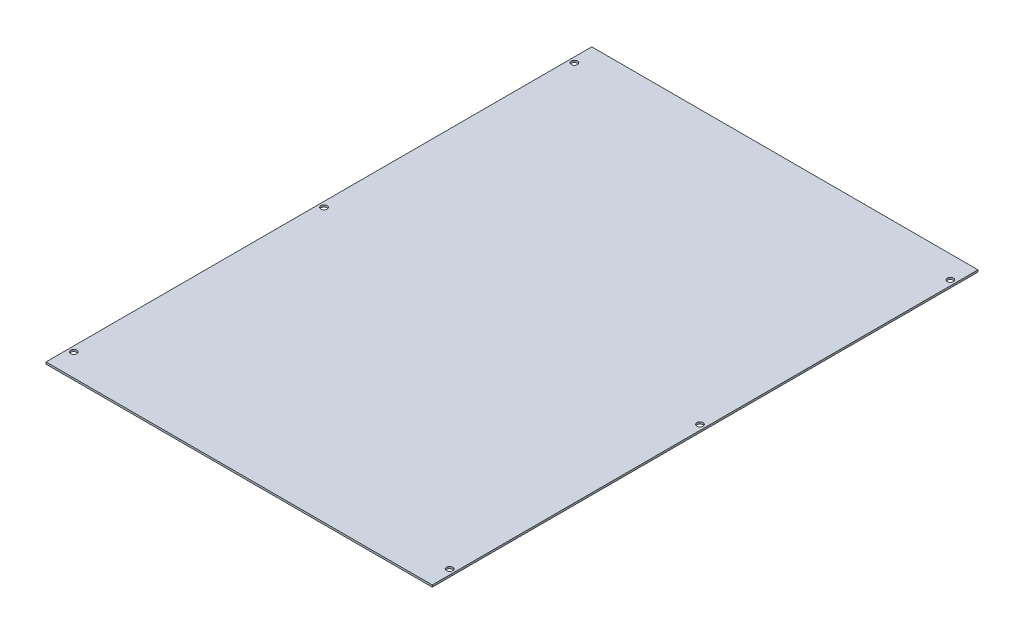
ISO-10303-21;
HEADER;
FILE_DESCRIPTION(('STEP AP214'),'2;1');
FILE_NAME('part.step','',(''),(''),'','','');
FILE_SCHEMA(('AUTOMOTIVE_DESIGN { 1 0 10303 214 1 1 1 1 }'));
ENDSEC;
DATA;
#1=APPLICATION_CONTEXT('core data for automotive mechanical design processes');
#2=APPLICATION_PROTOCOL_DEFINITION('international standard','automotive_design',2000,#1);
#3=PRODUCT_CONTEXT('',#1,'mechanical');
#4=PRODUCT('Part','Part','',(#3));
#5=PRODUCT_RELATED_PRODUCT_CATEGORY('part','',(#4));
#6=PRODUCT_DEFINITION_FORMATION('','',#4);
#7=PRODUCT_DEFINITION_CONTEXT('part definition',#1,'design');
#8=PRODUCT_DEFINITION('design','',#6,#7);
#9=PRODUCT_DEFINITION_SHAPE('','',#8);
#10=(LENGTH_UNIT() NAMED_UNIT(*) SI_UNIT(.MILLI.,.METRE.));
#11=(NAMED_UNIT(*) PLANE_ANGLE_UNIT() SI_UNIT($,.RADIAN.));
#12=(NAMED_UNIT(*) SI_UNIT($,.STERADIAN.) SOLID_ANGLE_UNIT());
#13=UNCERTAINTY_MEASURE_WITH_UNIT(LENGTH_MEASURE(1.E-05),#10,'distance_accuracy_value','');
#14=(GEOMETRIC_REPRESENTATION_CONTEXT(3) GLOBAL_UNCERTAINTY_ASSIGNED_CONTEXT((#13)) GLOBAL_UNIT_ASSIGNED_CONTEXT((#10,
#11,#12)) REPRESENTATION_CONTEXT('',''));
#15=CARTESIAN_POINT('',(0.,0.,0.));
#16=DIRECTION('',(0.,0.,1.));
#17=DIRECTION('',(1.,0.,0.));
#18=AXIS2_PLACEMENT_3D('',#15,#16,#17);
#19=CARTESIAN_POINT('',(159.25,1.6002,225.));
#20=DIRECTION('',(-1.,0.,0.));
#21=DIRECTION('',(0.,0.,1.));
#22=AXIS2_PLACEMENT_3D('',#19,#20,#21);
#23=PLANE('',#22);
#24=DIRECTION('',(0.,0.,-1.));
#25=VECTOR('',#24,1.);
#26=CARTESIAN_POINT('',(159.25,0.,225.));
#27=LINE('',#26,#25);
#28=CARTESIAN_POINT('',(159.25,0.,225.));
#29=VERTEX_POINT('',#28);
#30=CARTESIAN_POINT('',(159.25,0.,-225.));
#31=VERTEX_POINT('',#30);
#32=EDGE_CURVE('E98',#29,#31,#27,.T.);
#33=ORIENTED_EDGE('',*,*,#32,.T.);
#34=DIRECTION('',(0.,-1.,0.));
#35=VECTOR('',#34,1.);
#36=CARTESIAN_POINT('',(159.25,1.6002,-225.));
#37=LINE('',#36,#35);
#38=CARTESIAN_POINT('',(159.25,1.6002,-225.));
#39=VERTEX_POINT('',#38);
#40=EDGE_CURVE('E11',#39,#31,#37,.T.);
#41=ORIENTED_EDGE('',*,*,#40,.F.);
#42=DIRECTION('',(0.,0.,-1.));
#43=VECTOR('',#42,1.);
#44=CARTESIAN_POINT('',(159.25,1.6002,225.));
#45=LINE('',#44,#43);
#46=CARTESIAN_POINT('',(159.25,1.6002,225.));
#47=VERTEX_POINT('',#46);
#48=EDGE_CURVE('E85',#47,#39,#45,.T.);
#49=ORIENTED_EDGE('',*,*,#48,.F.);
#50=DIRECTION('',(0.,-1.,0.));
#51=VECTOR('',#50,1.);
#52=CARTESIAN_POINT('',(159.25,1.6002,225.));
#53=LINE('',#52,#51);
#54=EDGE_CURVE('E94',#47,#29,#53,.T.);
#55=ORIENTED_EDGE('',*,*,#54,.T.);
#56=EDGE_LOOP('',(#33,#41,#49,#55));
#57=FACE_BOUND('',#56,.T.);
#58=ADVANCED_FACE('F32',(#57),#23,.F.);
#59=CARTESIAN_POINT('',(-159.25,1.6002,-225.));
#60=DIRECTION('',(0.,0.,1.));
#61=DIRECTION('',(1.,0.,0.));
#62=AXIS2_PLACEMENT_3D('',#59,#60,#61);
#63=PLANE('',#62);
#64=DIRECTION('',(-1.,0.,0.));
#65=VECTOR('',#64,1.);
#66=CARTESIAN_POINT('',(-159.25,0.,-225.));
#67=LINE('',#66,#65);
#68=CARTESIAN_POINT('',(-159.25,0.,-225.));
#69=VERTEX_POINT('',#68);
#70=EDGE_CURVE('E89',#31,#69,#67,.T.);
#71=ORIENTED_EDGE('',*,*,#70,.T.);
#72=DIRECTION('',(0.,-1.,0.));
#73=VECTOR('',#72,1.);
#74=CARTESIAN_POINT('',(-159.25,1.6002,-225.));
#75=LINE('',#74,#73);
#76=CARTESIAN_POINT('',(-159.25,1.6002,-225.));
#77=VERTEX_POINT('',#76);
#78=EDGE_CURVE('E41',#77,#69,#75,.T.);
#79=ORIENTED_EDGE('',*,*,#78,.F.);
#80=DIRECTION('',(-1.,0.,0.));
#81=VECTOR('',#80,1.);
#82=CARTESIAN_POINT('',(-159.25,1.6002,-225.));
#83=LINE('',#82,#81);
#84=EDGE_CURVE('E80',#39,#77,#83,.T.);
#85=ORIENTED_EDGE('',*,*,#84,.F.);
#86=ORIENTED_EDGE('',*,*,#40,.T.);
#87=EDGE_LOOP('',(#71,#79,#85,#86));
#88=FACE_BOUND('',#87,.T.);
#89=ADVANCED_FACE('F88',(#88),#63,.F.);
#90=CARTESIAN_POINT('',(-159.25,1.6002,225.));
#91=DIRECTION('',(1.,0.,0.));
#92=DIRECTION('',(0.,0.,-1.));
#93=AXIS2_PLACEMENT_3D('',#90,#91,#92);
#94=PLANE('',#93);
#95=DIRECTION('',(0.,0.,1.));
#96=VECTOR('',#95,1.);
#97=CARTESIAN_POINT('',(-159.25,0.,225.));
#98=LINE('',#97,#96);
#99=CARTESIAN_POINT('',(-159.25,0.,225.));
#100=VERTEX_POINT('',#99);
#101=EDGE_CURVE('E67',#69,#100,#98,.T.);
#102=ORIENTED_EDGE('',*,*,#101,.T.);
#103=DIRECTION('',(0.,-1.,0.));
#104=VECTOR('',#103,1.);
#105=CARTESIAN_POINT('',(-159.25,1.6002,225.));
#106=LINE('',#105,#104);
#107=CARTESIAN_POINT('',(-159.25,1.6002,225.));
#108=VERTEX_POINT('',#107);
#109=EDGE_CURVE('E90',#108,#100,#106,.T.);
#110=ORIENTED_EDGE('',*,*,#109,.F.);
#111=DIRECTION('',(0.,0.,1.));
#112=VECTOR('',#111,1.);
#113=CARTESIAN_POINT('',(-159.25,1.6002,225.));
#114=LINE('',#113,#112);
#115=EDGE_CURVE('E83',#77,#108,#114,.T.);
#116=ORIENTED_EDGE('',*,*,#115,.F.);
#117=ORIENTED_EDGE('',*,*,#78,.T.);
#118=EDGE_LOOP('',(#102,#110,#116,#117));
#119=FACE_BOUND('',#118,.T.);
#120=ADVANCED_FACE('F92',(#119),#94,.F.);
#121=CARTESIAN_POINT('',(-159.25,1.6002,225.));
#122=DIRECTION('',(0.,0.,-1.));
#123=DIRECTION('',(-1.,0.,0.));
#124=AXIS2_PLACEMENT_3D('',#121,#122,#123);
#125=PLANE('',#124);
#126=DIRECTION('',(1.,0.,0.));
#127=VECTOR('',#126,1.);
#128=CARTESIAN_POINT('',(-159.25,0.,225.));
#129=LINE('',#128,#127);
#130=EDGE_CURVE('E73',#100,#29,#129,.T.);
#131=ORIENTED_EDGE('',*,*,#130,.T.);
#132=ORIENTED_EDGE('',*,*,#54,.F.);
#133=DIRECTION('',(1.,0.,0.));
#134=VECTOR('',#133,1.);
#135=CARTESIAN_POINT('',(-159.25,1.6002,225.));
#136=LINE('',#135,#134);
#137=EDGE_CURVE('E50',#108,#47,#136,.T.);
#138=ORIENTED_EDGE('',*,*,#137,.F.);
#139=ORIENTED_EDGE('',*,*,#109,.T.);
#140=EDGE_LOOP('',(#131,#132,#138,#139));
#141=FACE_BOUND('',#140,.T.);
#142=ADVANCED_FACE('F143',(#141),#125,.F.);
#143=CARTESIAN_POINT('',(0.,1.6002,0.));
#144=DIRECTION('',(0.,-1.,0.));
#145=DIRECTION('',(0.,0.,-1.));
#146=AXIS2_PLACEMENT_3D('',#143,#144,#145);
#147=PLANE('',#146);
#148=CARTESIAN_POINT('',(-155.,1.6002,-206.45));
#149=DIRECTION('',(0.,1.,0.));
#150=DIRECTION('',(0.,0.,1.));
#151=AXIS2_PLACEMENT_3D('',#148,#149,#150);
#152=CIRCLE('',#151,2.55269999999999);
#153=CARTESIAN_POINT('',(-155.,1.6002,-203.8973));
#154=VERTEX_POINT('',#153);
#155=EDGE_CURVE('E245',#154,#154,#152,.T.);
#156=ORIENTED_EDGE('',*,*,#155,.F.);
#157=EDGE_LOOP('',(#156));
#158=FACE_BOUND('',#157,.T.);
#159=CARTESIAN_POINT('',(155.,1.6002,-206.45));
#160=DIRECTION('',(0.,1.,0.));
#161=DIRECTION('',(0.,0.,1.));
#162=AXIS2_PLACEMENT_3D('',#159,#160,#161);
#163=CIRCLE('',#162,2.55269999999999);
#164=CARTESIAN_POINT('',(155.,1.6002,-203.8973));
#165=VERTEX_POINT('',#164);
#166=EDGE_CURVE('E247',#165,#165,#163,.T.);
#167=ORIENTED_EDGE('',*,*,#166,.F.);
#168=EDGE_LOOP('',(#167));
#169=FACE_BOUND('',#168,.T.);
#170=CARTESIAN_POINT('',(155.,1.6002,0.));
#171=DIRECTION('',(0.,1.,0.));
#172=DIRECTION('',(0.,0.,1.));
#173=AXIS2_PLACEMENT_3D('',#170,#171,#172);
#174=CIRCLE('',#173,2.55269999999999);
#175=CARTESIAN_POINT('',(155.,1.6002,2.55269999999994));
#176=VERTEX_POINT('',#175);
#177=EDGE_CURVE('E124',#176,#176,#174,.T.);
#178=ORIENTED_EDGE('',*,*,#177,.F.);
#179=EDGE_LOOP('',(#178));
#180=FACE_BOUND('',#179,.T.);
#181=CARTESIAN_POINT('',(155.,1.6002,206.45));
#182=DIRECTION('',(0.,1.,0.));
#183=DIRECTION('',(0.,0.,1.));
#184=AXIS2_PLACEMENT_3D('',#181,#182,#183);
#185=CIRCLE('',#184,2.55269999999999);
#186=CARTESIAN_POINT('',(155.,1.6002,209.0027));
#187=VERTEX_POINT('',#186);
#188=EDGE_CURVE('E113',#187,#187,#185,.T.);
#189=ORIENTED_EDGE('',*,*,#188,.F.);
#190=EDGE_LOOP('',(#189));
#191=FACE_BOUND('',#190,.T.);
#192=CARTESIAN_POINT('',(-155.,1.6002,206.45));
#193=DIRECTION('',(0.,1.,0.));
#194=DIRECTION('',(0.,0.,1.));
#195=AXIS2_PLACEMENT_3D('',#192,#193,#194);
#196=CIRCLE('',#195,2.55269999999999);
#197=CARTESIAN_POINT('',(-155.,1.6002,209.0027));
#198=VERTEX_POINT('',#197);
#199=EDGE_CURVE('E110',#198,#198,#196,.T.);
#200=ORIENTED_EDGE('',*,*,#199,.F.);
#201=EDGE_LOOP('',(#200));
#202=FACE_BOUND('',#201,.T.);
#203=CARTESIAN_POINT('',(-155.,1.6002,0.));
#204=DIRECTION('',(0.,1.,0.));
#205=DIRECTION('',(0.,0.,1.));
#206=AXIS2_PLACEMENT_3D('',#203,#204,#205);
#207=CIRCLE('',#206,2.55269999999999);
#208=CARTESIAN_POINT('',(-155.,1.6002,2.55269999999994));
#209=VERTEX_POINT('',#208);
#210=EDGE_CURVE('E109',#209,#209,#207,.T.);
#211=ORIENTED_EDGE('',*,*,#210,.F.);
#212=EDGE_LOOP('',(#211));
#213=FACE_BOUND('',#212,.T.);
#214=ORIENTED_EDGE('',*,*,#48,.T.);
#215=ORIENTED_EDGE('',*,*,#84,.T.);
#216=ORIENTED_EDGE('',*,*,#115,.T.);
#217=ORIENTED_EDGE('',*,*,#137,.T.);
#218=EDGE_LOOP('',(#214,#215,#216,#217));
#219=FACE_BOUND('',#218,.T.);
#220=ADVANCED_FACE('F81',(#158,#169,#180,#191,#202,#213,#219),#147,.F.);
#221=CARTESIAN_POINT('',(0.,0.,0.));
#222=DIRECTION('',(0.,-1.,0.));
#223=DIRECTION('',(0.,0.,-1.));
#224=AXIS2_PLACEMENT_3D('',#221,#222,#223);
#225=PLANE('',#224);
#226=CARTESIAN_POINT('',(-155.,0.,-206.45));
#227=DIRECTION('',(0.,-1.,0.));
#228=DIRECTION('',(0.,0.,-1.));
#229=AXIS2_PLACEMENT_3D('',#226,#227,#228);
#230=CIRCLE('',#229,2.55269999999998);
#231=CARTESIAN_POINT('',(-155.,0.,-209.0027));
#232=VERTEX_POINT('',#231);
#233=EDGE_CURVE('E35',#232,#232,#230,.T.);
#234=ORIENTED_EDGE('',*,*,#233,.F.);
#235=EDGE_LOOP('',(#234));
#236=FACE_BOUND('',#235,.T.);
#237=CARTESIAN_POINT('',(155.,0.,-206.45));
#238=DIRECTION('',(0.,-1.,0.));
#239=DIRECTION('',(0.,0.,-1.));
#240=AXIS2_PLACEMENT_3D('',#237,#238,#239);
#241=CIRCLE('',#240,2.55269999999998);
#242=CARTESIAN_POINT('',(155.,0.,-209.0027));
#243=VERTEX_POINT('',#242);
#244=EDGE_CURVE('E251',#243,#243,#241,.T.);
#245=ORIENTED_EDGE('',*,*,#244,.F.);
#246=EDGE_LOOP('',(#245));
#247=FACE_BOUND('',#246,.T.);
#248=CARTESIAN_POINT('',(155.,0.,0.));
#249=DIRECTION('',(0.,-1.,0.));
#250=DIRECTION('',(0.,0.,-1.));
#251=AXIS2_PLACEMENT_3D('',#248,#249,#250);
#252=CIRCLE('',#251,2.55269999999998);
#253=CARTESIAN_POINT('',(155.,0.,-2.55270000000003));
#254=VERTEX_POINT('',#253);
#255=EDGE_CURVE('E119',#254,#254,#252,.T.);
#256=ORIENTED_EDGE('',*,*,#255,.F.);
#257=EDGE_LOOP('',(#256));
#258=FACE_BOUND('',#257,.T.);
#259=CARTESIAN_POINT('',(155.,0.,206.45));
#260=DIRECTION('',(0.,-1.,0.));
#261=DIRECTION('',(0.,0.,-1.));
#262=AXIS2_PLACEMENT_3D('',#259,#260,#261);
#263=CIRCLE('',#262,2.55269999999998);
#264=CARTESIAN_POINT('',(155.,0.,203.8973));
#265=VERTEX_POINT('',#264);
#266=EDGE_CURVE('E111',#265,#265,#263,.T.);
#267=ORIENTED_EDGE('',*,*,#266,.F.);
#268=EDGE_LOOP('',(#267));
#269=FACE_BOUND('',#268,.T.);
#270=CARTESIAN_POINT('',(-155.,0.,206.45));
#271=DIRECTION('',(0.,-1.,0.));
#272=DIRECTION('',(0.,0.,-1.));
#273=AXIS2_PLACEMENT_3D('',#270,#271,#272);
#274=CIRCLE('',#273,2.55269999999998);
#275=CARTESIAN_POINT('',(-155.,0.,203.8973));
#276=VERTEX_POINT('',#275);
#277=EDGE_CURVE('E107',#276,#276,#274,.T.);
#278=ORIENTED_EDGE('',*,*,#277,.F.);
#279=EDGE_LOOP('',(#278));
#280=FACE_BOUND('',#279,.T.);
#281=CARTESIAN_POINT('',(-155.,0.,0.));
#282=DIRECTION('',(0.,-1.,0.));
#283=DIRECTION('',(0.,0.,-1.));
#284=AXIS2_PLACEMENT_3D('',#281,#282,#283);
#285=CIRCLE('',#284,2.55269999999998);
#286=CARTESIAN_POINT('',(-155.,0.,-2.55270000000003));
#287=VERTEX_POINT('',#286);
#288=EDGE_CURVE('E101',#287,#287,#285,.T.);
#289=ORIENTED_EDGE('',*,*,#288,.F.);
#290=EDGE_LOOP('',(#289));
#291=FACE_BOUND('',#290,.T.);
#292=ORIENTED_EDGE('',*,*,#32,.F.);
#293=ORIENTED_EDGE('',*,*,#130,.F.);
#294=ORIENTED_EDGE('',*,*,#101,.F.);
#295=ORIENTED_EDGE('',*,*,#70,.F.);
#296=EDGE_LOOP('',(#292,#293,#294,#295));
#297=FACE_BOUND('',#296,.T.);
#298=ADVANCED_FACE('F136',(#236,#247,#258,#269,#280,#291,#297),#225,.T.);
#299=CARTESIAN_POINT('',(-155.,1.6002,0.));
#300=DIRECTION('',(0.,1.,0.));
#301=DIRECTION('',(0.,0.,1.));
#302=AXIS2_PLACEMENT_3D('',#299,#300,#301);
#303=CYLINDRICAL_SURFACE('',#302,2.55269999999998);
#304=ORIENTED_EDGE('',*,*,#288,.T.);
#305=EDGE_LOOP('',(#304));
#306=FACE_BOUND('',#305,.T.);
#307=ORIENTED_EDGE('',*,*,#210,.T.);
#308=EDGE_LOOP('',(#307));
#309=FACE_BOUND('',#308,.T.);
#310=ADVANCED_FACE('F133',(#306,#309),#303,.F.);
#311=CARTESIAN_POINT('',(-155.,1.6002,206.45));
#312=DIRECTION('',(0.,1.,0.));
#313=DIRECTION('',(0.,0.,1.));
#314=AXIS2_PLACEMENT_3D('',#311,#312,#313);
#315=CYLINDRICAL_SURFACE('',#314,2.55269999999998);
#316=ORIENTED_EDGE('',*,*,#277,.T.);
#317=EDGE_LOOP('',(#316));
#318=FACE_BOUND('',#317,.T.);
#319=ORIENTED_EDGE('',*,*,#199,.T.);
#320=EDGE_LOOP('',(#319));
#321=FACE_BOUND('',#320,.T.);
#322=ADVANCED_FACE('F188',(#318,#321),#315,.F.);
#323=CARTESIAN_POINT('',(155.,1.6002,206.45));
#324=DIRECTION('',(0.,1.,0.));
#325=DIRECTION('',(0.,0.,1.));
#326=AXIS2_PLACEMENT_3D('',#323,#324,#325);
#327=CYLINDRICAL_SURFACE('',#326,2.55269999999998);
#328=ORIENTED_EDGE('',*,*,#266,.T.);
#329=EDGE_LOOP('',(#328));
#330=FACE_BOUND('',#329,.T.);
#331=ORIENTED_EDGE('',*,*,#188,.T.);
#332=EDGE_LOOP('',(#331));
#333=FACE_BOUND('',#332,.T.);
#334=ADVANCED_FACE('F197',(#330,#333),#327,.F.);
#335=CARTESIAN_POINT('',(155.,1.6002,0.));
#336=DIRECTION('',(0.,1.,0.));
#337=DIRECTION('',(0.,0.,1.));
#338=AXIS2_PLACEMENT_3D('',#335,#336,#337);
#339=CYLINDRICAL_SURFACE('',#338,2.55269999999998);
#340=ORIENTED_EDGE('',*,*,#255,.T.);
#341=EDGE_LOOP('',(#340));
#342=FACE_BOUND('',#341,.T.);
#343=ORIENTED_EDGE('',*,*,#177,.T.);
#344=EDGE_LOOP('',(#343));
#345=FACE_BOUND('',#344,.T.);
#346=ADVANCED_FACE('F207',(#342,#345),#339,.F.);
#347=CARTESIAN_POINT('',(155.,1.6002,-206.45));
#348=DIRECTION('',(0.,1.,0.));
#349=DIRECTION('',(0.,0.,1.));
#350=AXIS2_PLACEMENT_3D('',#347,#348,#349);
#351=CYLINDRICAL_SURFACE('',#350,2.55269999999998);
#352=ORIENTED_EDGE('',*,*,#244,.T.);
#353=EDGE_LOOP('',(#352));
#354=FACE_BOUND('',#353,.T.);
#355=ORIENTED_EDGE('',*,*,#166,.T.);
#356=EDGE_LOOP('',(#355));
#357=FACE_BOUND('',#356,.T.);
#358=ADVANCED_FACE('F216',(#354,#357),#351,.F.);
#359=CARTESIAN_POINT('',(-155.,1.6002,-206.45));
#360=DIRECTION('',(0.,1.,0.));
#361=DIRECTION('',(0.,0.,1.));
#362=AXIS2_PLACEMENT_3D('',#359,#360,#361);
#363=CYLINDRICAL_SURFACE('',#362,2.55269999999998);
#364=ORIENTED_EDGE('',*,*,#233,.T.);
#365=EDGE_LOOP('',(#364));
#366=FACE_BOUND('',#365,.T.);
#367=ORIENTED_EDGE('',*,*,#155,.T.);
#368=EDGE_LOOP('',(#367));
#369=FACE_BOUND('',#368,.T.);
#370=ADVANCED_FACE('F226',(#366,#369),#363,.F.);
#371=CLOSED_SHELL('',(#58,#89,#120,#142,#220,#298,#310,#322,#334,#346,#358,#370));
#372=MANIFOLD_SOLID_BREP('B2',#371);
#373=ADVANCED_BREP_SHAPE_REPRESENTATION('',(#18,#372),#14);
#374=SHAPE_DEFINITION_REPRESENTATION(#9,#373);
ENDSEC;
END-ISO-10303-21;
